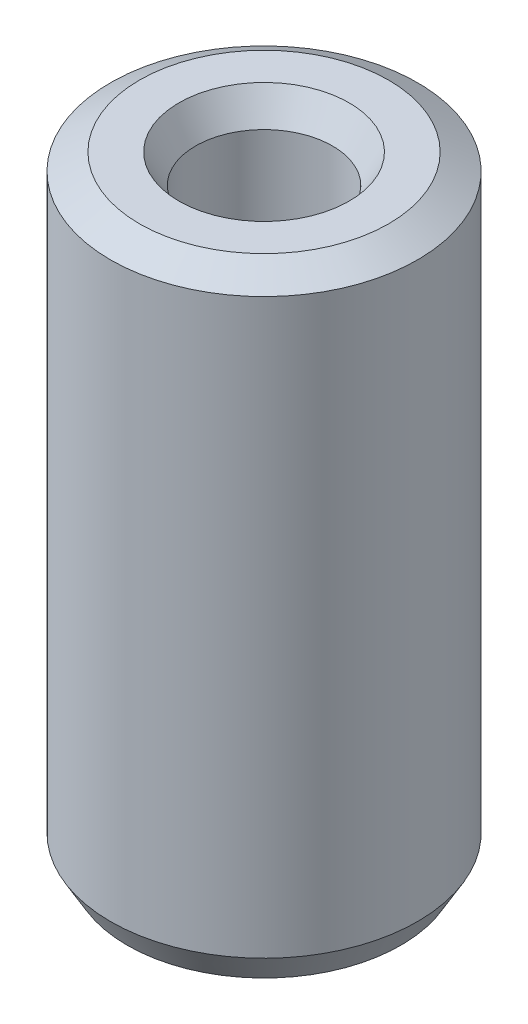
ISO-10303-21;
HEADER;
FILE_DESCRIPTION(('STEP AP214'),'2;1');
FILE_NAME('part.step','',(''),(''),'','','');
FILE_SCHEMA(('AUTOMOTIVE_DESIGN { 1 0 10303 214 1 1 1 1 }'));
ENDSEC;
DATA;
#1=APPLICATION_CONTEXT('core data for automotive mechanical design processes');
#2=APPLICATION_PROTOCOL_DEFINITION('international standard','automotive_design',2000,#1);
#3=PRODUCT_CONTEXT('',#1,'mechanical');
#4=PRODUCT('Part','Part','',(#3));
#5=PRODUCT_RELATED_PRODUCT_CATEGORY('part','',(#4));
#6=PRODUCT_DEFINITION_FORMATION('','',#4);
#7=PRODUCT_DEFINITION_CONTEXT('part definition',#1,'design');
#8=PRODUCT_DEFINITION('design','',#6,#7);
#9=PRODUCT_DEFINITION_SHAPE('','',#8);
#10=(LENGTH_UNIT() NAMED_UNIT(*) SI_UNIT(.MILLI.,.METRE.));
#11=(NAMED_UNIT(*) PLANE_ANGLE_UNIT() SI_UNIT($,.RADIAN.));
#12=(NAMED_UNIT(*) SI_UNIT($,.STERADIAN.) SOLID_ANGLE_UNIT());
#13=UNCERTAINTY_MEASURE_WITH_UNIT(LENGTH_MEASURE(1.E-05),#10,'distance_accuracy_value','');
#14=(GEOMETRIC_REPRESENTATION_CONTEXT(3) GLOBAL_UNCERTAINTY_ASSIGNED_CONTEXT((#13)) GLOBAL_UNIT_ASSIGNED_CONTEXT((#10,
#11,#12)) REPRESENTATION_CONTEXT('',''));
#15=CARTESIAN_POINT('',(0.,0.,0.));
#16=DIRECTION('',(0.,0.,1.));
#17=DIRECTION('',(1.,0.,0.));
#18=AXIS2_PLACEMENT_3D('',#15,#16,#17);
#19=CARTESIAN_POINT('',(0.,90.6885763487138,0.));
#20=DIRECTION('',(0.,-1.,0.));
#21=DIRECTION('',(0.,0.,-1.));
#22=AXIS2_PLACEMENT_3D('',#19,#20,#21);
#23=CYLINDRICAL_SURFACE('',#22,22.5);
#24=CARTESIAN_POINT('',(0.,4.24486018729094,0.));
#25=DIRECTION('',(0.,1.,0.));
#26=DIRECTION('',(0.,0.,1.));
#27=AXIS2_PLACEMENT_3D('',#24,#25,#26);
#28=CIRCLE('',#27,22.5);
#29=CARTESIAN_POINT('',(0.,4.24486018729094,22.5));
#30=VERTEX_POINT('',#29);
#31=EDGE_CURVE('E10',#30,#30,#28,.T.);
#32=ORIENTED_EDGE('',*,*,#31,.T.);
#33=EDGE_LOOP('',(#32));
#34=FACE_BOUND('',#33,.T.);
#35=CARTESIAN_POINT('',(0.,88.2378051769091,0.));
#36=DIRECTION('',(0.,1.,0.));
#37=DIRECTION('',(0.,0.,1.));
#38=AXIS2_PLACEMENT_3D('',#35,#36,#37);
#39=CIRCLE('',#38,22.5);
#40=CARTESIAN_POINT('',(0.,88.2378051769091,22.5));
#41=VERTEX_POINT('',#40);
#42=EDGE_CURVE('E50',#41,#41,#39,.F.);
#43=ORIENTED_EDGE('',*,*,#42,.T.);
#44=EDGE_LOOP('',(#43));
#45=FACE_BOUND('',#44,.T.);
#46=ADVANCED_FACE('F39',(#34,#45),#23,.T.);
#47=CARTESIAN_POINT('',(0.,90.6885763487138,0.));
#48=DIRECTION('',(0.,1.,0.));
#49=DIRECTION('',(0.,0.,1.));
#50=AXIS2_PLACEMENT_3D('',#47,#48,#49);
#51=PLANE('',#50);
#52=CARTESIAN_POINT('',(0.,90.6885763487138,0.));
#53=DIRECTION('',(0.,1.,0.));
#54=DIRECTION('',(0.,0.,1.));
#55=AXIS2_PLACEMENT_3D('',#52,#53,#54);
#56=CIRCLE('',#55,12.4820969954313);
#57=CARTESIAN_POINT('',(0.,90.6885763487138,12.4820969954313));
#58=VERTEX_POINT('',#57);
#59=EDGE_CURVE('E58',#58,#58,#56,.F.);
#60=ORIENTED_EDGE('',*,*,#59,.T.);
#61=EDGE_LOOP('',(#60));
#62=FACE_BOUND('',#61,.T.);
#63=CARTESIAN_POINT('',(0.,90.6885763487138,0.));
#64=DIRECTION('',(0.,1.,0.));
#65=DIRECTION('',(0.,0.,1.));
#66=AXIS2_PLACEMENT_3D('',#63,#64,#65);
#67=CIRCLE('',#66,18.255139812709);
#68=CARTESIAN_POINT('',(0.,90.6885763487138,18.255139812709));
#69=VERTEX_POINT('',#68);
#70=EDGE_CURVE('E61',#69,#69,#67,.T.);
#71=ORIENTED_EDGE('',*,*,#70,.T.);
#72=EDGE_LOOP('',(#71));
#73=FACE_BOUND('',#72,.T.);
#74=ADVANCED_FACE('F88',(#62,#73),#51,.T.);
#75=CARTESIAN_POINT('',(0.,0.,0.));
#76=DIRECTION('',(0.,1.,0.));
#77=DIRECTION('',(0.,0.,1.));
#78=AXIS2_PLACEMENT_3D('',#75,#76,#77);
#79=PLANE('',#78);
#80=CARTESIAN_POINT('',(0.,0.,0.));
#81=DIRECTION('',(0.,1.,0.));
#82=DIRECTION('',(0.,0.,1.));
#83=AXIS2_PLACEMENT_3D('',#80,#81,#82);
#84=CIRCLE('',#83,14.2761860109175);
#85=CARTESIAN_POINT('',(0.,0.,14.2761860109175));
#86=VERTEX_POINT('',#85);
#87=EDGE_CURVE('E51',#86,#86,#84,.T.);
#88=ORIENTED_EDGE('',*,*,#87,.T.);
#89=EDGE_LOOP('',(#88));
#90=FACE_BOUND('',#89,.T.);
#91=CARTESIAN_POINT('',(0.,0.,0.));
#92=DIRECTION('',(0.,1.,0.));
#93=DIRECTION('',(0.,0.,1.));
#94=AXIS2_PLACEMENT_3D('',#91,#92,#93);
#95=CIRCLE('',#94,20.0492288281952);
#96=CARTESIAN_POINT('',(0.,0.,20.0492288281952));
#97=VERTEX_POINT('',#96);
#98=EDGE_CURVE('E54',#97,#97,#95,.F.);
#99=ORIENTED_EDGE('',*,*,#98,.T.);
#100=EDGE_LOOP('',(#99));
#101=FACE_BOUND('',#100,.T.);
#102=ADVANCED_FACE('F83',(#90,#101),#79,.F.);
#103=CARTESIAN_POINT('',(0.,90.6885763487138,0.));
#104=DIRECTION('',(0.,-1.,0.));
#105=DIRECTION('',(0.,0.,-1.));
#106=AXIS2_PLACEMENT_3D('',#103,#104,#105);
#107=CYLINDRICAL_SURFACE('',#106,10.0313258236265);
#108=CARTESIAN_POINT('',(0.,86.4437161614229,0.));
#109=DIRECTION('',(0.,1.,0.));
#110=DIRECTION('',(0.,0.,1.));
#111=AXIS2_PLACEMENT_3D('',#108,#109,#110);
#112=CIRCLE('',#111,10.0313258236265);
#113=CARTESIAN_POINT('',(0.,86.4437161614229,10.0313258236265));
#114=VERTEX_POINT('',#113);
#115=EDGE_CURVE('E67',#114,#114,#112,.T.);
#116=ORIENTED_EDGE('',*,*,#115,.T.);
#117=EDGE_LOOP('',(#116));
#118=FACE_BOUND('',#117,.T.);
#119=CARTESIAN_POINT('',(0.,2.45077117180477,0.));
#120=DIRECTION('',(0.,1.,0.));
#121=DIRECTION('',(0.,0.,1.));
#122=AXIS2_PLACEMENT_3D('',#119,#120,#121);
#123=CIRCLE('',#122,10.0313258236265);
#124=CARTESIAN_POINT('',(0.,2.45077117180477,10.0313258236265));
#125=VERTEX_POINT('',#124);
#126=EDGE_CURVE('E69',#125,#125,#123,.F.);
#127=ORIENTED_EDGE('',*,*,#126,.T.);
#128=EDGE_LOOP('',(#127));
#129=FACE_BOUND('',#128,.T.);
#130=ADVANCED_FACE('F71',(#118,#129),#107,.F.);
#131=CARTESIAN_POINT('',(0.,86.4437161614229,0.));
#132=DIRECTION('',(0.,1.,0.));
#133=DIRECTION('',(0.,0.,1.));
#134=AXIS2_PLACEMENT_3D('',#131,#132,#133);
#135=CONICAL_SURFACE('',#134,10.0313258236265,0.523598775598304);
#136=ORIENTED_EDGE('',*,*,#59,.F.);
#137=EDGE_LOOP('',(#136));
#138=FACE_BOUND('',#137,.T.);
#139=ORIENTED_EDGE('',*,*,#115,.F.);
#140=EDGE_LOOP('',(#139));
#141=FACE_BOUND('',#140,.T.);
#142=ADVANCED_FACE('F77',(#138,#141),#135,.F.);
#143=CARTESIAN_POINT('',(0.,0.,0.));
#144=DIRECTION('',(0.,-1.,0.));
#145=DIRECTION('',(0.,0.,-1.));
#146=AXIS2_PLACEMENT_3D('',#143,#144,#145);
#147=CONICAL_SURFACE('',#146,14.2761860109175,1.04719755119659);
#148=ORIENTED_EDGE('',*,*,#126,.F.);
#149=EDGE_LOOP('',(#148));
#150=FACE_BOUND('',#149,.T.);
#151=ORIENTED_EDGE('',*,*,#87,.F.);
#152=EDGE_LOOP('',(#151));
#153=FACE_BOUND('',#152,.T.);
#154=ADVANCED_FACE('F73',(#150,#153),#147,.F.);
#155=CARTESIAN_POINT('',(0.,4.24486018729094,0.));
#156=DIRECTION('',(0.,1.,0.));
#157=DIRECTION('',(0.,0.,1.));
#158=AXIS2_PLACEMENT_3D('',#155,#156,#157);
#159=CONICAL_SURFACE('',#158,22.5,0.523598775598303);
#160=ORIENTED_EDGE('',*,*,#98,.F.);
#161=EDGE_LOOP('',(#160));
#162=FACE_BOUND('',#161,.T.);
#163=ORIENTED_EDGE('',*,*,#31,.F.);
#164=EDGE_LOOP('',(#163));
#165=FACE_BOUND('',#164,.T.);
#166=ADVANCED_FACE('F76',(#162,#165),#159,.T.);
#167=CARTESIAN_POINT('',(0.,90.6885763487138,0.));
#168=DIRECTION('',(0.,-1.,0.));
#169=DIRECTION('',(0.,0.,-1.));
#170=AXIS2_PLACEMENT_3D('',#167,#168,#169);
#171=CONICAL_SURFACE('',#170,18.255139812709,1.0471975511966);
#172=ORIENTED_EDGE('',*,*,#42,.F.);
#173=EDGE_LOOP('',(#172));
#174=FACE_BOUND('',#173,.T.);
#175=ORIENTED_EDGE('',*,*,#70,.F.);
#176=EDGE_LOOP('',(#175));
#177=FACE_BOUND('',#176,.T.);
#178=ADVANCED_FACE('F45',(#174,#177),#171,.T.);
#179=CLOSED_SHELL('',(#46,#74,#102,#130,#142,#154,#166,#178));
#180=MANIFOLD_SOLID_BREP('B2',#179);
#181=ADVANCED_BREP_SHAPE_REPRESENTATION('',(#18,#180),#14);
#182=SHAPE_DEFINITION_REPRESENTATION(#9,#181);
ENDSEC;
END-ISO-10303-21;
